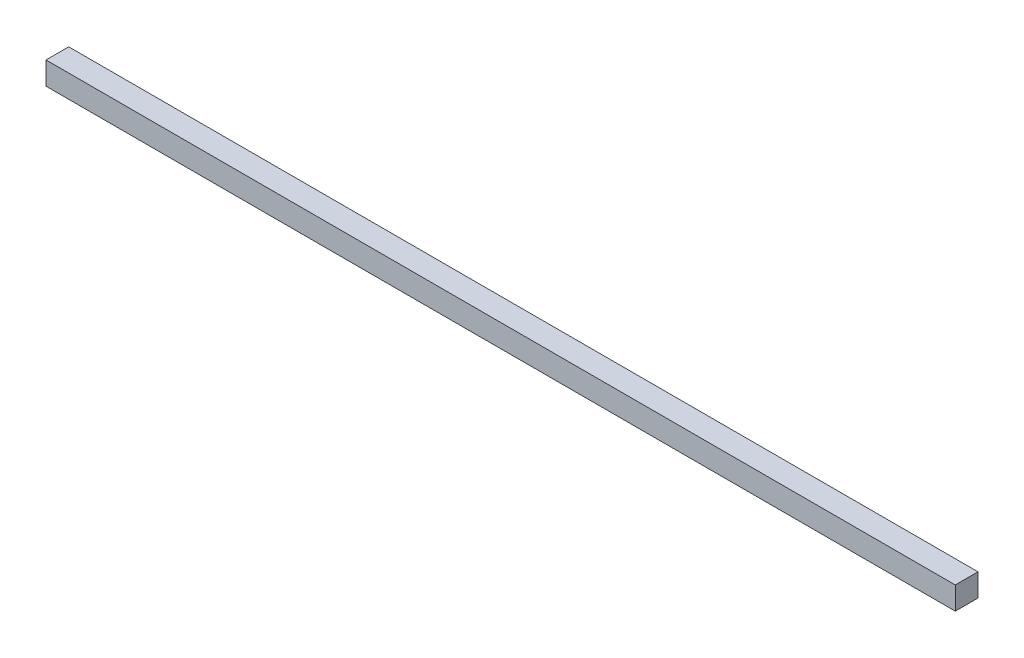
ISO-10303-21;
HEADER;
FILE_DESCRIPTION(('STEP AP214'),'2;1');
FILE_NAME('part.step','',(''),(''),'','','');
FILE_SCHEMA(('AUTOMOTIVE_DESIGN { 1 0 10303 214 1 1 1 1 }'));
ENDSEC;
DATA;
#1=APPLICATION_CONTEXT('core data for automotive mechanical design processes');
#2=APPLICATION_PROTOCOL_DEFINITION('international standard','automotive_design',2000,#1);
#3=PRODUCT_CONTEXT('',#1,'mechanical');
#4=PRODUCT('Part','Part','',(#3));
#5=PRODUCT_RELATED_PRODUCT_CATEGORY('part','',(#4));
#6=PRODUCT_DEFINITION_FORMATION('','',#4);
#7=PRODUCT_DEFINITION_CONTEXT('part definition',#1,'design');
#8=PRODUCT_DEFINITION('design','',#6,#7);
#9=PRODUCT_DEFINITION_SHAPE('','',#8);
#10=(LENGTH_UNIT() NAMED_UNIT(*) SI_UNIT(.MILLI.,.METRE.));
#11=(NAMED_UNIT(*) PLANE_ANGLE_UNIT() SI_UNIT($,.RADIAN.));
#12=(NAMED_UNIT(*) SI_UNIT($,.STERADIAN.) SOLID_ANGLE_UNIT());
#13=UNCERTAINTY_MEASURE_WITH_UNIT(LENGTH_MEASURE(1.E-05),#10,'distance_accuracy_value','');
#14=(GEOMETRIC_REPRESENTATION_CONTEXT(3) GLOBAL_UNCERTAINTY_ASSIGNED_CONTEXT((#13)) GLOBAL_UNIT_ASSIGNED_CONTEXT((#10,
#11,#12)) REPRESENTATION_CONTEXT('',''));
#15=CARTESIAN_POINT('',(0.,0.,0.));
#16=DIRECTION('',(0.,0.,1.));
#17=DIRECTION('',(1.,0.,0.));
#18=AXIS2_PLACEMENT_3D('',#15,#16,#17);
#19=CARTESIAN_POINT('',(-200.,10.,-4.99999999999998));
#20=DIRECTION('',(1.,0.,0.));
#21=DIRECTION('',(0.,0.,-1.));
#22=AXIS2_PLACEMENT_3D('',#19,#20,#21);
#23=PLANE('',#22);
#24=DIRECTION('',(0.,0.,1.));
#25=VECTOR('',#24,1.);
#26=CARTESIAN_POINT('',(-200.,0.,-4.99999999999998));
#27=LINE('',#26,#25);
#28=CARTESIAN_POINT('',(-200.,0.,-4.99999999999998));
#29=VERTEX_POINT('',#28);
#30=CARTESIAN_POINT('',(-200.,0.,5.));
#31=VERTEX_POINT('',#30);
#32=EDGE_CURVE('E97',#29,#31,#27,.T.);
#33=ORIENTED_EDGE('',*,*,#32,.T.);
#34=DIRECTION('',(0.,-1.,0.));
#35=VECTOR('',#34,1.);
#36=CARTESIAN_POINT('',(-200.,10.,5.));
#37=LINE('',#36,#35);
#38=CARTESIAN_POINT('',(-200.,10.,5.));
#39=VERTEX_POINT('',#38);
#40=EDGE_CURVE('E11',#39,#31,#37,.T.);
#41=ORIENTED_EDGE('',*,*,#40,.F.);
#42=DIRECTION('',(0.,0.,1.));
#43=VECTOR('',#42,1.);
#44=CARTESIAN_POINT('',(-200.,10.,-4.99999999999998));
#45=LINE('',#44,#43);
#46=CARTESIAN_POINT('',(-200.,10.,-4.99999999999998));
#47=VERTEX_POINT('',#46);
#48=EDGE_CURVE('E85',#47,#39,#45,.T.);
#49=ORIENTED_EDGE('',*,*,#48,.F.);
#50=DIRECTION('',(0.,-1.,0.));
#51=VECTOR('',#50,1.);
#52=CARTESIAN_POINT('',(-200.,10.,-4.99999999999998));
#53=LINE('',#52,#51);
#54=EDGE_CURVE('E93',#47,#29,#53,.T.);
#55=ORIENTED_EDGE('',*,*,#54,.T.);
#56=EDGE_LOOP('',(#33,#41,#49,#55));
#57=FACE_BOUND('',#56,.T.);
#58=ADVANCED_FACE('F34',(#57),#23,.F.);
#59=CARTESIAN_POINT('',(-200.,10.,5.));
#60=DIRECTION('',(0.,0.,-1.));
#61=DIRECTION('',(-1.,0.,0.));
#62=AXIS2_PLACEMENT_3D('',#59,#60,#61);
#63=PLANE('',#62);
#64=DIRECTION('',(1.,0.,0.));
#65=VECTOR('',#64,1.);
#66=CARTESIAN_POINT('',(-200.,0.,5.));
#67=LINE('',#66,#65);
#68=CARTESIAN_POINT('',(200.,0.,5.));
#69=VERTEX_POINT('',#68);
#70=EDGE_CURVE('E89',#31,#69,#67,.T.);
#71=ORIENTED_EDGE('',*,*,#70,.T.);
#72=DIRECTION('',(0.,-1.,0.));
#73=VECTOR('',#72,1.);
#74=CARTESIAN_POINT('',(200.,10.,5.));
#75=LINE('',#74,#73);
#76=CARTESIAN_POINT('',(200.,10.,5.));
#77=VERTEX_POINT('',#76);
#78=EDGE_CURVE('E42',#77,#69,#75,.T.);
#79=ORIENTED_EDGE('',*,*,#78,.F.);
#80=DIRECTION('',(1.,0.,0.));
#81=VECTOR('',#80,1.);
#82=CARTESIAN_POINT('',(-200.,10.,5.));
#83=LINE('',#82,#81);
#84=EDGE_CURVE('E80',#39,#77,#83,.T.);
#85=ORIENTED_EDGE('',*,*,#84,.F.);
#86=ORIENTED_EDGE('',*,*,#40,.T.);
#87=EDGE_LOOP('',(#71,#79,#85,#86));
#88=FACE_BOUND('',#87,.T.);
#89=ADVANCED_FACE('F88',(#88),#63,.F.);
#90=CARTESIAN_POINT('',(200.,10.,-4.99999999999998));
#91=DIRECTION('',(-1.,0.,0.));
#92=DIRECTION('',(0.,0.,1.));
#93=AXIS2_PLACEMENT_3D('',#90,#91,#92);
#94=PLANE('',#93);
#95=DIRECTION('',(0.,0.,-1.));
#96=VECTOR('',#95,1.);
#97=CARTESIAN_POINT('',(200.,0.,-4.99999999999998));
#98=LINE('',#97,#96);
#99=CARTESIAN_POINT('',(200.,0.,-4.99999999999998));
#100=VERTEX_POINT('',#99);
#101=EDGE_CURVE('E67',#69,#100,#98,.T.);
#102=ORIENTED_EDGE('',*,*,#101,.T.);
#103=DIRECTION('',(0.,-1.,0.));
#104=VECTOR('',#103,1.);
#105=CARTESIAN_POINT('',(200.,10.,-4.99999999999998));
#106=LINE('',#105,#104);
#107=CARTESIAN_POINT('',(200.,10.,-4.99999999999998));
#108=VERTEX_POINT('',#107);
#109=EDGE_CURVE('E90',#108,#100,#106,.T.);
#110=ORIENTED_EDGE('',*,*,#109,.F.);
#111=DIRECTION('',(0.,0.,-1.));
#112=VECTOR('',#111,1.);
#113=CARTESIAN_POINT('',(200.,10.,-4.99999999999998));
#114=LINE('',#113,#112);
#115=EDGE_CURVE('E83',#77,#108,#114,.T.);
#116=ORIENTED_EDGE('',*,*,#115,.F.);
#117=ORIENTED_EDGE('',*,*,#78,.T.);
#118=EDGE_LOOP('',(#102,#110,#116,#117));
#119=FACE_BOUND('',#118,.T.);
#120=ADVANCED_FACE('F91',(#119),#94,.F.);
#121=CARTESIAN_POINT('',(-200.,10.,-4.99999999999998));
#122=DIRECTION('',(0.,0.,1.));
#123=DIRECTION('',(1.,0.,0.));
#124=AXIS2_PLACEMENT_3D('',#121,#122,#123);
#125=PLANE('',#124);
#126=DIRECTION('',(-1.,0.,0.));
#127=VECTOR('',#126,1.);
#128=CARTESIAN_POINT('',(-200.,0.,-4.99999999999998));
#129=LINE('',#128,#127);
#130=EDGE_CURVE('E73',#100,#29,#129,.T.);
#131=ORIENTED_EDGE('',*,*,#130,.T.);
#132=ORIENTED_EDGE('',*,*,#54,.F.);
#133=DIRECTION('',(-1.,0.,0.));
#134=VECTOR('',#133,1.);
#135=CARTESIAN_POINT('',(-200.,10.,-4.99999999999998));
#136=LINE('',#135,#134);
#137=EDGE_CURVE('E50',#108,#47,#136,.T.);
#138=ORIENTED_EDGE('',*,*,#137,.F.);
#139=ORIENTED_EDGE('',*,*,#109,.T.);
#140=EDGE_LOOP('',(#131,#132,#138,#139));
#141=FACE_BOUND('',#140,.T.);
#142=ADVANCED_FACE('F104',(#141),#125,.F.);
#143=CARTESIAN_POINT('',(0.,10.,0.));
#144=DIRECTION('',(0.,1.,0.));
#145=DIRECTION('',(0.,0.,1.));
#146=AXIS2_PLACEMENT_3D('',#143,#144,#145);
#147=PLANE('',#146);
#148=ORIENTED_EDGE('',*,*,#48,.T.);
#149=ORIENTED_EDGE('',*,*,#84,.T.);
#150=ORIENTED_EDGE('',*,*,#115,.T.);
#151=ORIENTED_EDGE('',*,*,#137,.T.);
#152=EDGE_LOOP('',(#148,#149,#150,#151));
#153=FACE_BOUND('',#152,.T.);
#154=ADVANCED_FACE('F81',(#153),#147,.T.);
#155=CARTESIAN_POINT('',(0.,0.,0.));
#156=DIRECTION('',(0.,1.,0.));
#157=DIRECTION('',(0.,0.,1.));
#158=AXIS2_PLACEMENT_3D('',#155,#156,#157);
#159=PLANE('',#158);
#160=ORIENTED_EDGE('',*,*,#32,.F.);
#161=ORIENTED_EDGE('',*,*,#130,.F.);
#162=ORIENTED_EDGE('',*,*,#101,.F.);
#163=ORIENTED_EDGE('',*,*,#70,.F.);
#164=EDGE_LOOP('',(#160,#161,#162,#163));
#165=FACE_BOUND('',#164,.T.);
#166=ADVANCED_FACE('F107',(#165),#159,.F.);
#167=CLOSED_SHELL('',(#58,#89,#120,#142,#154,#166));
#168=MANIFOLD_SOLID_BREP('B2',#167);
#169=ADVANCED_BREP_SHAPE_REPRESENTATION('',(#18,#168),#14);
#170=SHAPE_DEFINITION_REPRESENTATION(#9,#169);
ENDSEC;
END-ISO-10303-21;
